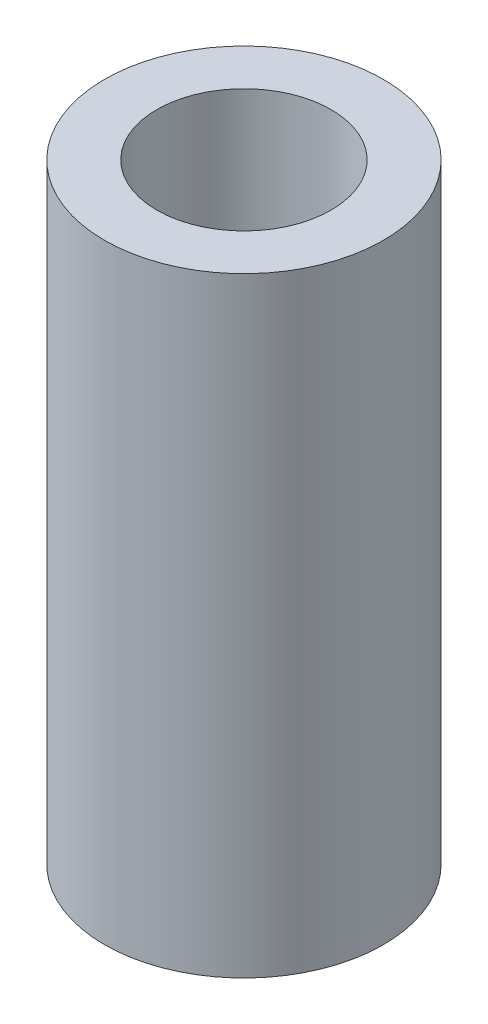
ISO-10303-21;
HEADER;
FILE_DESCRIPTION(('STEP AP214'),'2;1');
FILE_NAME('part.step','',(''),(''),'','','');
FILE_SCHEMA(('AUTOMOTIVE_DESIGN { 1 0 10303 214 1 1 1 1 }'));
ENDSEC;
DATA;
#1=APPLICATION_CONTEXT('core data for automotive mechanical design processes');
#2=APPLICATION_PROTOCOL_DEFINITION('international standard','automotive_design',2000,#1);
#3=PRODUCT_CONTEXT('',#1,'mechanical');
#4=PRODUCT('Part','Part','',(#3));
#5=PRODUCT_RELATED_PRODUCT_CATEGORY('part','',(#4));
#6=PRODUCT_DEFINITION_FORMATION('','',#4);
#7=PRODUCT_DEFINITION_CONTEXT('part definition',#1,'design');
#8=PRODUCT_DEFINITION('design','',#6,#7);
#9=PRODUCT_DEFINITION_SHAPE('','',#8);
#10=(LENGTH_UNIT() NAMED_UNIT(*) SI_UNIT(.MILLI.,.METRE.));
#11=(NAMED_UNIT(*) PLANE_ANGLE_UNIT() SI_UNIT($,.RADIAN.));
#12=(NAMED_UNIT(*) SI_UNIT($,.STERADIAN.) SOLID_ANGLE_UNIT());
#13=UNCERTAINTY_MEASURE_WITH_UNIT(LENGTH_MEASURE(1.E-05),#10,'distance_accuracy_value','');
#14=(GEOMETRIC_REPRESENTATION_CONTEXT(3) GLOBAL_UNCERTAINTY_ASSIGNED_CONTEXT((#13)) GLOBAL_UNIT_ASSIGNED_CONTEXT((#10,
#11,#12)) REPRESENTATION_CONTEXT('',''));
#15=CARTESIAN_POINT('',(0.,0.,0.));
#16=DIRECTION('',(0.,0.,1.));
#17=DIRECTION('',(1.,0.,0.));
#18=AXIS2_PLACEMENT_3D('',#15,#16,#17);
#19=CARTESIAN_POINT('',(0.,35.,0.));
#20=DIRECTION('',(0.,1.,0.));
#21=DIRECTION('',(0.,0.,1.));
#22=AXIS2_PLACEMENT_3D('',#19,#20,#21);
#23=PLANE('',#22);
#24=CARTESIAN_POINT('',(0.,35.,0.));
#25=DIRECTION('',(0.,1.,0.));
#26=DIRECTION('',(0.,0.,1.));
#27=AXIS2_PLACEMENT_3D('',#24,#25,#26);
#28=CIRCLE('',#27,8.);
#29=CARTESIAN_POINT('',(0.,35.,8.));
#30=VERTEX_POINT('',#29);
#31=EDGE_CURVE('E10',#30,#30,#28,.T.);
#32=ORIENTED_EDGE('',*,*,#31,.T.);
#33=EDGE_LOOP('',(#32));
#34=FACE_BOUND('',#33,.T.);
#35=CARTESIAN_POINT('',(0.,35.,0.));
#36=DIRECTION('',(0.,1.,0.));
#37=DIRECTION('',(0.,0.,1.));
#38=AXIS2_PLACEMENT_3D('',#35,#36,#37);
#39=CIRCLE('',#38,5.);
#40=CARTESIAN_POINT('',(0.,35.,5.));
#41=VERTEX_POINT('',#40);
#42=EDGE_CURVE('E42',#41,#41,#39,.T.);
#43=ORIENTED_EDGE('',*,*,#42,.F.);
#44=EDGE_LOOP('',(#43));
#45=FACE_BOUND('',#44,.T.);
#46=ADVANCED_FACE('F31',(#34,#45),#23,.T.);
#47=CARTESIAN_POINT('',(0.,0.,0.));
#48=DIRECTION('',(0.,1.,0.));
#49=DIRECTION('',(0.,0.,1.));
#50=AXIS2_PLACEMENT_3D('',#47,#48,#49);
#51=PLANE('',#50);
#52=CARTESIAN_POINT('',(0.,0.,0.));
#53=DIRECTION('',(0.,1.,0.));
#54=DIRECTION('',(0.,0.,1.));
#55=AXIS2_PLACEMENT_3D('',#52,#53,#54);
#56=CIRCLE('',#55,8.);
#57=CARTESIAN_POINT('',(0.,0.,8.));
#58=VERTEX_POINT('',#57);
#59=EDGE_CURVE('E35',#58,#58,#56,.T.);
#60=ORIENTED_EDGE('',*,*,#59,.F.);
#61=EDGE_LOOP('',(#60));
#62=FACE_BOUND('',#61,.T.);
#63=CARTESIAN_POINT('',(0.,0.,0.));
#64=DIRECTION('',(0.,1.,0.));
#65=DIRECTION('',(0.,0.,1.));
#66=AXIS2_PLACEMENT_3D('',#63,#64,#65);
#67=CIRCLE('',#66,5.);
#68=CARTESIAN_POINT('',(0.,0.,5.));
#69=VERTEX_POINT('',#68);
#70=EDGE_CURVE('E44',#69,#69,#67,.T.);
#71=ORIENTED_EDGE('',*,*,#70,.T.);
#72=EDGE_LOOP('',(#71));
#73=FACE_BOUND('',#72,.T.);
#74=ADVANCED_FACE('F54',(#62,#73),#51,.F.);
#75=CARTESIAN_POINT('',(0.,35.,0.));
#76=DIRECTION('',(0.,-1.,0.));
#77=DIRECTION('',(0.,0.,-1.));
#78=AXIS2_PLACEMENT_3D('',#75,#76,#77);
#79=CYLINDRICAL_SURFACE('',#78,8.);
#80=ORIENTED_EDGE('',*,*,#31,.F.);
#81=EDGE_LOOP('',(#80));
#82=FACE_BOUND('',#81,.T.);
#83=ORIENTED_EDGE('',*,*,#59,.T.);
#84=EDGE_LOOP('',(#83));
#85=FACE_BOUND('',#84,.T.);
#86=ADVANCED_FACE('F33',(#82,#85),#79,.T.);
#87=CARTESIAN_POINT('',(0.,35.,0.));
#88=DIRECTION('',(0.,-1.,0.));
#89=DIRECTION('',(0.,0.,-1.));
#90=AXIS2_PLACEMENT_3D('',#87,#88,#89);
#91=CYLINDRICAL_SURFACE('',#90,5.);
#92=ORIENTED_EDGE('',*,*,#42,.T.);
#93=EDGE_LOOP('',(#92));
#94=FACE_BOUND('',#93,.T.);
#95=ORIENTED_EDGE('',*,*,#70,.F.);
#96=EDGE_LOOP('',(#95));
#97=FACE_BOUND('',#96,.T.);
#98=ADVANCED_FACE('F50',(#94,#97),#91,.F.);
#99=CLOSED_SHELL('',(#46,#74,#86,#98));
#100=MANIFOLD_SOLID_BREP('B2',#99);
#101=ADVANCED_BREP_SHAPE_REPRESENTATION('',(#18,#100),#14);
#102=SHAPE_DEFINITION_REPRESENTATION(#9,#101);
ENDSEC;
END-ISO-10303-21;
